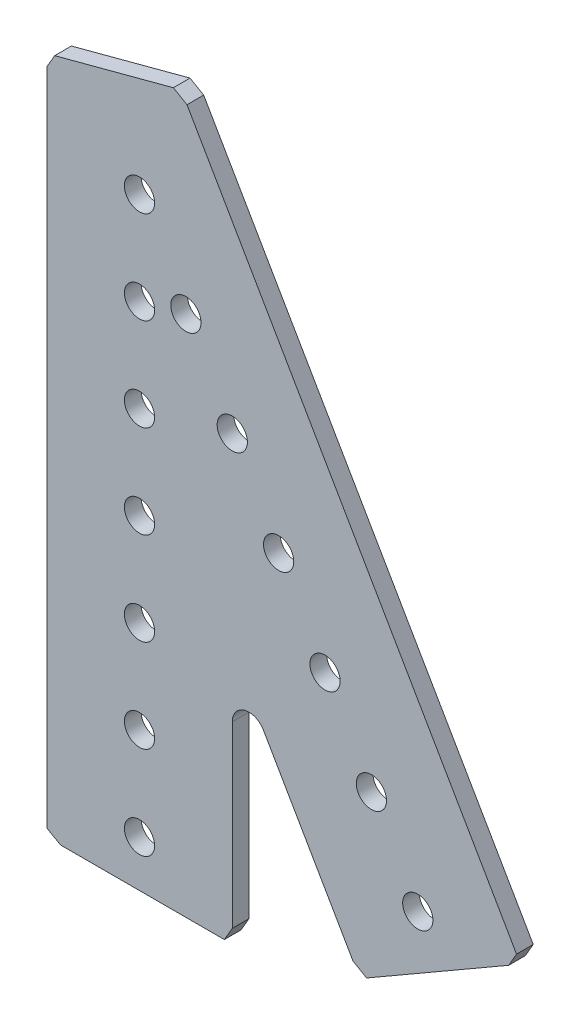
ISO-10303-21;
HEADER;
FILE_DESCRIPTION(('STEP AP214'),'2;1');
FILE_NAME('part.step','',(''),(''),'','','');
FILE_SCHEMA(('AUTOMOTIVE_DESIGN { 1 0 10303 214 1 1 1 1 }'));
ENDSEC;
DATA;
#1=APPLICATION_CONTEXT('core data for automotive mechanical design processes');
#2=APPLICATION_PROTOCOL_DEFINITION('international standard','automotive_design',2000,#1);
#3=PRODUCT_CONTEXT('',#1,'mechanical');
#4=PRODUCT('Part','Part','',(#3));
#5=PRODUCT_RELATED_PRODUCT_CATEGORY('part','',(#4));
#6=PRODUCT_DEFINITION_FORMATION('','',#4);
#7=PRODUCT_DEFINITION_CONTEXT('part definition',#1,'design');
#8=PRODUCT_DEFINITION('design','',#6,#7);
#9=PRODUCT_DEFINITION_SHAPE('','',#8);
#10=(LENGTH_UNIT() NAMED_UNIT(*) SI_UNIT(.MILLI.,.METRE.));
#11=(NAMED_UNIT(*) PLANE_ANGLE_UNIT() SI_UNIT($,.RADIAN.));
#12=(NAMED_UNIT(*) SI_UNIT($,.STERADIAN.) SOLID_ANGLE_UNIT());
#13=UNCERTAINTY_MEASURE_WITH_UNIT(LENGTH_MEASURE(1.E-05),#10,'distance_accuracy_value','');
#14=(GEOMETRIC_REPRESENTATION_CONTEXT(3) GLOBAL_UNCERTAINTY_ASSIGNED_CONTEXT((#13)) GLOBAL_UNIT_ASSIGNED_CONTEXT((#10,
#11,#12)) REPRESENTATION_CONTEXT('',''));
#15=CARTESIAN_POINT('',(0.,0.,0.));
#16=DIRECTION('',(0.,0.,1.));
#17=DIRECTION('',(1.,0.,0.));
#18=AXIS2_PLACEMENT_3D('',#15,#16,#17);
#19=CARTESIAN_POINT('',(31.098420175516,-77.3658481835008,2.286));
#20=DIRECTION('',(-0.501574169410907,-0.865114647072721,0.));
#21=DIRECTION('',(0.865114647072721,-0.501574169410907,0.));
#22=AXIS2_PLACEMENT_3D('',#19,#20,#21);
#23=PLANE('',#22);
#24=DIRECTION('',(-0.865114647072721,0.501574169410907,0.));
#25=VECTOR('',#24,1.);
#26=CARTESIAN_POINT('',(31.098420175516,-77.3658481835008,0.));
#27=LINE('',#26,#25);
#28=CARTESIAN_POINT('',(31.098420175516,-77.3658481835008,0.));
#29=VERTEX_POINT('',#28);
#30=CARTESIAN_POINT('',(29.230637652486,-76.2829495517427,0.));
#31=VERTEX_POINT('',#30);
#32=EDGE_CURVE('E166',#29,#31,#27,.T.);
#33=ORIENTED_EDGE('',*,*,#32,.F.);
#34=DIRECTION('',(0.,0.,-1.));
#35=VECTOR('',#34,1.);
#36=CARTESIAN_POINT('',(31.098420175516,-77.3658481835008,2.286));
#37=LINE('',#36,#35);
#38=CARTESIAN_POINT('',(31.098420175516,-77.3658481835008,2.286));
#39=VERTEX_POINT('',#38);
#40=EDGE_CURVE('E11',#39,#29,#37,.T.);
#41=ORIENTED_EDGE('',*,*,#40,.F.);
#42=DIRECTION('',(-0.865114647072721,0.501574169410907,0.));
#43=VECTOR('',#42,1.);
#44=CARTESIAN_POINT('',(31.098420175516,-77.3658481835008,2.286));
#45=LINE('',#44,#43);
#46=CARTESIAN_POINT('',(29.230637652486,-76.2829495517427,2.286));
#47=VERTEX_POINT('',#46);
#48=EDGE_CURVE('E205',#39,#47,#45,.T.);
#49=ORIENTED_EDGE('',*,*,#48,.T.);
#50=DIRECTION('',(0.,0.,-1.));
#51=VECTOR('',#50,1.);
#52=CARTESIAN_POINT('',(29.230637652486,-76.2829495517427,2.286));
#53=LINE('',#52,#51);
#54=EDGE_CURVE('E36',#47,#31,#53,.T.);
#55=ORIENTED_EDGE('',*,*,#54,.T.);
#56=EDGE_LOOP('',(#33,#41,#49,#55));
#57=FACE_BOUND('',#56,.T.);
#58=ADVANCED_FACE('F33',(#57),#23,.T.);
#59=CARTESIAN_POINT('',(50.5425898711182,-66.1397515755763,2.286));
#60=DIRECTION('',(0.499999999999995,-0.866025403784442,0.));
#61=DIRECTION('',(0.866025403784442,0.499999999999995,0.));
#62=AXIS2_PLACEMENT_3D('',#59,#60,#61);
#63=PLANE('',#62);
#64=DIRECTION('',(-0.866025403784442,-0.499999999999995,0.));
#65=VECTOR('',#64,1.);
#66=CARTESIAN_POINT('',(50.5425898711182,-66.1397515755763,0.));
#67=LINE('',#66,#65);
#68=CARTESIAN_POINT('',(50.5425898711182,-66.1397515755763,0.));
#69=VERTEX_POINT('',#68);
#70=EDGE_CURVE('E203',#69,#29,#67,.T.);
#71=ORIENTED_EDGE('',*,*,#70,.F.);
#72=DIRECTION('',(0.,0.,-1.));
#73=VECTOR('',#72,1.);
#74=CARTESIAN_POINT('',(50.5425898711182,-66.1397515755763,2.286));
#75=LINE('',#74,#73);
#76=CARTESIAN_POINT('',(50.5425898711182,-66.1397515755763,2.286));
#77=VERTEX_POINT('',#76);
#78=EDGE_CURVE('E42',#77,#69,#75,.T.);
#79=ORIENTED_EDGE('',*,*,#78,.F.);
#80=DIRECTION('',(-0.866025403784442,-0.499999999999995,0.));
#81=VECTOR('',#80,1.);
#82=CARTESIAN_POINT('',(50.5425898711182,-66.1397515755763,2.286));
#83=LINE('',#82,#81);
#84=EDGE_CURVE('E156',#77,#39,#83,.T.);
#85=ORIENTED_EDGE('',*,*,#84,.T.);
#86=ORIENTED_EDGE('',*,*,#40,.T.);
#87=EDGE_LOOP('',(#71,#79,#85,#86));
#88=FACE_BOUND('',#87,.T.);
#89=ADVANCED_FACE('F229',(#88),#63,.T.);
#90=CARTESIAN_POINT('',(51.6254885028765,-64.2719690525461,2.286));
#91=DIRECTION('',(0.865114647072718,-0.501574169410912,0.));
#92=DIRECTION('',(0.501574169410913,0.865114647072718,0.));
#93=AXIS2_PLACEMENT_3D('',#90,#91,#92);
#94=PLANE('',#93);
#95=DIRECTION('',(-0.501574169410913,-0.865114647072718,0.));
#96=VECTOR('',#95,1.);
#97=CARTESIAN_POINT('',(51.6254885028765,-64.2719690525461,0.));
#98=LINE('',#97,#96);
#99=CARTESIAN_POINT('',(51.6254885028765,-64.2719690525461,0.));
#100=VERTEX_POINT('',#99);
#101=EDGE_CURVE('E143',#100,#69,#98,.T.);
#102=ORIENTED_EDGE('',*,*,#101,.F.);
#103=DIRECTION('',(0.,0.,-1.));
#104=VECTOR('',#103,1.);
#105=CARTESIAN_POINT('',(51.6254885028765,-64.2719690525461,2.286));
#106=LINE('',#105,#104);
#107=CARTESIAN_POINT('',(51.6254885028765,-64.2719690525461,2.286));
#108=VERTEX_POINT('',#107);
#109=EDGE_CURVE('E138',#108,#100,#106,.T.);
#110=ORIENTED_EDGE('',*,*,#109,.F.);
#111=DIRECTION('',(-0.501574169410913,-0.865114647072718,0.));
#112=VECTOR('',#111,1.);
#113=CARTESIAN_POINT('',(51.6254885028765,-64.2719690525461,2.286));
#114=LINE('',#113,#112);
#115=EDGE_CURVE('E141',#108,#77,#114,.T.);
#116=ORIENTED_EDGE('',*,*,#115,.T.);
#117=ORIENTED_EDGE('',*,*,#78,.T.);
#118=EDGE_LOOP('',(#102,#110,#116,#117));
#119=FACE_BOUND('',#118,.T.);
#120=ADVANCED_FACE('F140',(#119),#94,.T.);
#121=CARTESIAN_POINT('',(6.50045885004739,13.8868749992073,2.286));
#122=DIRECTION('',(0.866025403784442,0.499999999999994,0.));
#123=DIRECTION('',(-0.499999999999995,0.866025403784442,0.));
#124=AXIS2_PLACEMENT_3D('',#121,#122,#123);
#125=PLANE('',#124);
#126=DIRECTION('',(0.499999999999994,-0.866025403784442,0.));
#127=VECTOR('',#126,1.);
#128=CARTESIAN_POINT('',(6.50045885004739,13.8868749992073,0.));
#129=LINE('',#128,#127);
#130=CARTESIAN_POINT('',(6.50045885004739,13.8868749992073,0.));
#131=VERTEX_POINT('',#130);
#132=EDGE_CURVE('E200',#131,#100,#129,.T.);
#133=ORIENTED_EDGE('',*,*,#132,.F.);
#134=DIRECTION('',(0.,0.,-1.));
#135=VECTOR('',#134,1.);
#136=CARTESIAN_POINT('',(6.50045885004739,13.8868749992073,2.286));
#137=LINE('',#136,#135);
#138=CARTESIAN_POINT('',(6.50045885004739,13.8868749992073,2.286));
#139=VERTEX_POINT('',#138);
#140=EDGE_CURVE('E148',#139,#131,#137,.T.);
#141=ORIENTED_EDGE('',*,*,#140,.F.);
#142=DIRECTION('',(0.499999999999994,-0.866025403784442,0.));
#143=VECTOR('',#142,1.);
#144=CARTESIAN_POINT('',(6.50045885004739,13.8868749992073,2.286));
#145=LINE('',#144,#143);
#146=EDGE_CURVE('E154',#139,#108,#145,.T.);
#147=ORIENTED_EDGE('',*,*,#146,.T.);
#148=ORIENTED_EDGE('',*,*,#109,.T.);
#149=EDGE_LOOP('',(#133,#141,#147,#148));
#150=FACE_BOUND('',#149,.T.);
#151=ADVANCED_FACE('F158',(#150),#125,.T.);
#152=CARTESIAN_POINT('',(4.63267632701638,14.969773630966,2.286));
#153=DIRECTION('',(0.501574169410913,0.865114647072718,0.));
#154=DIRECTION('',(-0.865114647072718,0.501574169410913,0.));
#155=AXIS2_PLACEMENT_3D('',#152,#153,#154);
#156=PLANE('',#155);
#157=DIRECTION('',(0.865114647072718,-0.501574169410913,0.));
#158=VECTOR('',#157,1.);
#159=CARTESIAN_POINT('',(4.63267632701638,14.969773630966,0.));
#160=LINE('',#159,#158);
#161=CARTESIAN_POINT('',(4.63267632701638,14.969773630966,0.));
#162=VERTEX_POINT('',#161);
#163=EDGE_CURVE('E197',#162,#131,#160,.T.);
#164=ORIENTED_EDGE('',*,*,#163,.F.);
#165=DIRECTION('',(0.,0.,-1.));
#166=VECTOR('',#165,1.);
#167=CARTESIAN_POINT('',(4.63267632701638,14.969773630966,2.286));
#168=LINE('',#167,#166);
#169=CARTESIAN_POINT('',(4.63267632701638,14.969773630966,2.286));
#170=VERTEX_POINT('',#169);
#171=EDGE_CURVE('E209',#170,#162,#168,.T.);
#172=ORIENTED_EDGE('',*,*,#171,.F.);
#173=DIRECTION('',(0.865114647072718,-0.501574169410913,0.));
#174=VECTOR('',#173,1.);
#175=CARTESIAN_POINT('',(4.63267632701638,14.969773630966,2.286));
#176=LINE('',#175,#174);
#177=EDGE_CURVE('E159',#170,#139,#176,.T.);
#178=ORIENTED_EDGE('',*,*,#177,.T.);
#179=ORIENTED_EDGE('',*,*,#140,.T.);
#180=EDGE_LOOP('',(#164,#172,#178,#179));
#181=FACE_BOUND('',#180,.T.);
#182=ADVANCED_FACE('F242',(#181),#156,.T.);
#183=CARTESIAN_POINT('',(-11.6171013682418,10.6473178722135,2.286));
#184=DIRECTION('',(-0.257061936990462,0.966394929907392,0.));
#185=DIRECTION('',(-0.966394929907391,-0.257061936990462,0.));
#186=AXIS2_PLACEMENT_3D('',#183,#184,#185);
#187=PLANE('',#186);
#188=DIRECTION('',(0.966394929907391,0.257061936990462,0.));
#189=VECTOR('',#188,1.);
#190=CARTESIAN_POINT('',(-11.6171013682418,10.6473178722135,0.));
#191=LINE('',#190,#189);
#192=CARTESIAN_POINT('',(-11.6171013682418,10.6473178722135,0.));
#193=VERTEX_POINT('',#192);
#194=EDGE_CURVE('E194',#193,#162,#191,.T.);
#195=ORIENTED_EDGE('',*,*,#194,.F.);
#196=DIRECTION('',(0.,0.,-1.));
#197=VECTOR('',#196,1.);
#198=CARTESIAN_POINT('',(-11.6171013682418,10.6473178722135,2.286));
#199=LINE('',#198,#197);
#200=CARTESIAN_POINT('',(-11.6171013682418,10.6473178722135,2.286));
#201=VERTEX_POINT('',#200);
#202=EDGE_CURVE('E211',#201,#193,#199,.T.);
#203=ORIENTED_EDGE('',*,*,#202,.F.);
#204=DIRECTION('',(0.966394929907391,0.257061936990462,0.));
#205=VECTOR('',#204,1.);
#206=CARTESIAN_POINT('',(-11.6171013682418,10.6473178722135,2.286));
#207=LINE('',#206,#205);
#208=EDGE_CURVE('E161',#201,#170,#207,.T.);
#209=ORIENTED_EDGE('',*,*,#208,.T.);
#210=ORIENTED_EDGE('',*,*,#171,.T.);
#211=EDGE_LOOP('',(#195,#203,#209,#210));
#212=FACE_BOUND('',#211,.T.);
#213=ADVANCED_FACE('F245',(#212),#187,.T.);
#214=CARTESIAN_POINT('',(-12.7,8.77953534918344,2.286));
#215=DIRECTION('',(-0.865114647072722,0.501574169410905,0.));
#216=DIRECTION('',(-0.501574169410906,-0.865114647072722,0.));
#217=AXIS2_PLACEMENT_3D('',#214,#215,#216);
#218=PLANE('',#217);
#219=DIRECTION('',(0.501574169410905,0.865114647072722,0.));
#220=VECTOR('',#219,1.);
#221=CARTESIAN_POINT('',(-12.7,8.77953534918344,0.));
#222=LINE('',#221,#220);
#223=CARTESIAN_POINT('',(-12.7,8.77953534918344,0.));
#224=VERTEX_POINT('',#223);
#225=EDGE_CURVE('E191',#224,#193,#222,.T.);
#226=ORIENTED_EDGE('',*,*,#225,.F.);
#227=DIRECTION('',(0.,0.,-1.));
#228=VECTOR('',#227,1.);
#229=CARTESIAN_POINT('',(-12.7,8.77953534918344,2.286));
#230=LINE('',#229,#228);
#231=CARTESIAN_POINT('',(-12.7,8.77953534918344,2.286));
#232=VERTEX_POINT('',#231);
#233=EDGE_CURVE('E213',#232,#224,#230,.T.);
#234=ORIENTED_EDGE('',*,*,#233,.F.);
#235=DIRECTION('',(0.501574169410905,0.865114647072722,0.));
#236=VECTOR('',#235,1.);
#237=CARTESIAN_POINT('',(-12.7,8.77953534918344,2.286));
#238=LINE('',#237,#236);
#239=EDGE_CURVE('E443',#232,#201,#238,.T.);
#240=ORIENTED_EDGE('',*,*,#239,.T.);
#241=ORIENTED_EDGE('',*,*,#202,.T.);
#242=EDGE_LOOP('',(#226,#234,#240,#241));
#243=FACE_BOUND('',#242,.T.);
#244=ADVANCED_FACE('F249',(#243),#218,.T.);
#245=CARTESIAN_POINT('',(-12.7,-81.4671013682419,2.286));
#246=DIRECTION('',(-1.,0.,0.));
#247=DIRECTION('',(0.,-1.,0.));
#248=AXIS2_PLACEMENT_3D('',#245,#246,#247);
#249=PLANE('',#248);
#250=DIRECTION('',(0.,1.,0.));
#251=VECTOR('',#250,1.);
#252=CARTESIAN_POINT('',(-12.7,-81.4671013682419,0.));
#253=LINE('',#252,#251);
#254=CARTESIAN_POINT('',(-12.7,-81.4671013682419,0.));
#255=VERTEX_POINT('',#254);
#256=EDGE_CURVE('E188',#255,#224,#253,.T.);
#257=ORIENTED_EDGE('',*,*,#256,.F.);
#258=DIRECTION('',(0.,0.,-1.));
#259=VECTOR('',#258,1.);
#260=CARTESIAN_POINT('',(-12.7,-81.4671013682419,2.286));
#261=LINE('',#260,#259);
#262=CARTESIAN_POINT('',(-12.7,-81.4671013682419,2.286));
#263=VERTEX_POINT('',#262);
#264=EDGE_CURVE('E215',#263,#255,#261,.T.);
#265=ORIENTED_EDGE('',*,*,#264,.F.);
#266=DIRECTION('',(0.,1.,0.));
#267=VECTOR('',#266,1.);
#268=CARTESIAN_POINT('',(-12.7,-81.4671013682419,2.286));
#269=LINE('',#268,#267);
#270=EDGE_CURVE('E440',#263,#232,#269,.T.);
#271=ORIENTED_EDGE('',*,*,#270,.T.);
#272=ORIENTED_EDGE('',*,*,#233,.T.);
#273=EDGE_LOOP('',(#257,#265,#271,#272));
#274=FACE_BOUND('',#273,.T.);
#275=ADVANCED_FACE('F253',(#274),#249,.T.);
#276=CARTESIAN_POINT('',(-10.83221747697,-82.55,2.286));
#277=DIRECTION('',(-0.501574169410903,-0.865114647072723,0.));
#278=DIRECTION('',(0.865114647072723,-0.501574169410903,0.));
#279=AXIS2_PLACEMENT_3D('',#276,#277,#278);
#280=PLANE('',#279);
#281=DIRECTION('',(-0.865114647072723,0.501574169410903,0.));
#282=VECTOR('',#281,1.);
#283=CARTESIAN_POINT('',(-10.83221747697,-82.55,0.));
#284=LINE('',#283,#282);
#285=CARTESIAN_POINT('',(-10.83221747697,-82.55,0.));
#286=VERTEX_POINT('',#285);
#287=EDGE_CURVE('E185',#286,#255,#284,.T.);
#288=ORIENTED_EDGE('',*,*,#287,.F.);
#289=DIRECTION('',(0.,0.,-1.));
#290=VECTOR('',#289,1.);
#291=CARTESIAN_POINT('',(-10.83221747697,-82.55,2.286));
#292=LINE('',#291,#290);
#293=CARTESIAN_POINT('',(-10.83221747697,-82.55,2.286));
#294=VERTEX_POINT('',#293);
#295=EDGE_CURVE('E217',#294,#286,#292,.T.);
#296=ORIENTED_EDGE('',*,*,#295,.F.);
#297=DIRECTION('',(-0.865114647072723,0.501574169410903,0.));
#298=VECTOR('',#297,1.);
#299=CARTESIAN_POINT('',(-10.83221747697,-82.55,2.286));
#300=LINE('',#299,#298);
#301=EDGE_CURVE('E437',#294,#263,#300,.T.);
#302=ORIENTED_EDGE('',*,*,#301,.T.);
#303=ORIENTED_EDGE('',*,*,#264,.T.);
#304=EDGE_LOOP('',(#288,#296,#302,#303));
#305=FACE_BOUND('',#304,.T.);
#306=ADVANCED_FACE('F257',(#305),#280,.T.);
#307=CARTESIAN_POINT('',(11.6171013682419,-82.55,2.286));
#308=DIRECTION('',(0.,-1.,0.));
#309=DIRECTION('',(0.,0.,-1.));
#310=AXIS2_PLACEMENT_3D('',#307,#308,#309);
#311=PLANE('',#310);
#312=DIRECTION('',(-1.,0.,0.));
#313=VECTOR('',#312,1.);
#314=CARTESIAN_POINT('',(11.6171013682419,-82.55,0.));
#315=LINE('',#314,#313);
#316=CARTESIAN_POINT('',(11.6171013682419,-82.55,0.));
#317=VERTEX_POINT('',#316);
#318=EDGE_CURVE('E182',#317,#286,#315,.T.);
#319=ORIENTED_EDGE('',*,*,#318,.F.);
#320=DIRECTION('',(0.,0.,-1.));
#321=VECTOR('',#320,1.);
#322=CARTESIAN_POINT('',(11.6171013682419,-82.55,2.286));
#323=LINE('',#322,#321);
#324=CARTESIAN_POINT('',(11.6171013682419,-82.55,2.286));
#325=VERTEX_POINT('',#324);
#326=EDGE_CURVE('E219',#325,#317,#323,.T.);
#327=ORIENTED_EDGE('',*,*,#326,.F.);
#328=DIRECTION('',(-1.,0.,0.));
#329=VECTOR('',#328,1.);
#330=CARTESIAN_POINT('',(11.6171013682419,-82.55,2.286));
#331=LINE('',#330,#329);
#332=EDGE_CURVE('E434',#325,#294,#331,.T.);
#333=ORIENTED_EDGE('',*,*,#332,.T.);
#334=ORIENTED_EDGE('',*,*,#295,.T.);
#335=EDGE_LOOP('',(#319,#327,#333,#334));
#336=FACE_BOUND('',#335,.T.);
#337=ADVANCED_FACE('F261',(#336),#311,.T.);
#338=CARTESIAN_POINT('',(12.7,-80.68221747697,2.286));
#339=DIRECTION('',(0.865114647072722,-0.501574169410906,0.));
#340=DIRECTION('',(0.501574169410906,0.865114647072722,0.));
#341=AXIS2_PLACEMENT_3D('',#338,#339,#340);
#342=PLANE('',#341);
#343=DIRECTION('',(-0.501574169410906,-0.865114647072722,0.));
#344=VECTOR('',#343,1.);
#345=CARTESIAN_POINT('',(12.7,-80.68221747697,0.));
#346=LINE('',#345,#344);
#347=CARTESIAN_POINT('',(12.7,-80.68221747697,0.));
#348=VERTEX_POINT('',#347);
#349=EDGE_CURVE('E179',#348,#317,#346,.T.);
#350=ORIENTED_EDGE('',*,*,#349,.F.);
#351=DIRECTION('',(0.,0.,-1.));
#352=VECTOR('',#351,1.);
#353=CARTESIAN_POINT('',(12.7,-80.68221747697,2.286));
#354=LINE('',#353,#352);
#355=CARTESIAN_POINT('',(12.7,-80.68221747697,2.286));
#356=VERTEX_POINT('',#355);
#357=EDGE_CURVE('E221',#356,#348,#354,.T.);
#358=ORIENTED_EDGE('',*,*,#357,.F.);
#359=DIRECTION('',(-0.501574169410906,-0.865114647072722,0.));
#360=VECTOR('',#359,1.);
#361=CARTESIAN_POINT('',(12.7,-80.68221747697,2.286));
#362=LINE('',#361,#360);
#363=EDGE_CURVE('E431',#356,#325,#362,.T.);
#364=ORIENTED_EDGE('',*,*,#363,.T.);
#365=ORIENTED_EDGE('',*,*,#326,.T.);
#366=EDGE_LOOP('',(#350,#358,#364,#365));
#367=FACE_BOUND('',#366,.T.);
#368=ADVANCED_FACE('F265',(#367),#342,.T.);
#369=CARTESIAN_POINT('',(12.7,-56.1825134022283,2.286));
#370=DIRECTION('',(1.,0.,0.));
#371=DIRECTION('',(0.,0.,-1.));
#372=AXIS2_PLACEMENT_3D('',#369,#370,#371);
#373=PLANE('',#372);
#374=DIRECTION('',(0.,-1.,0.));
#375=VECTOR('',#374,1.);
#376=CARTESIAN_POINT('',(12.7,-56.1825134022283,0.));
#377=LINE('',#376,#375);
#378=CARTESIAN_POINT('',(12.7,-56.1825134022283,0.));
#379=VERTEX_POINT('',#378);
#380=EDGE_CURVE('E176',#379,#348,#377,.T.);
#381=ORIENTED_EDGE('',*,*,#380,.F.);
#382=DIRECTION('',(0.,0.,-1.));
#383=VECTOR('',#382,1.);
#384=CARTESIAN_POINT('',(12.7,-56.1825134022283,2.286));
#385=LINE('',#384,#383);
#386=CARTESIAN_POINT('',(12.7,-56.1825134022283,2.286));
#387=VERTEX_POINT('',#386);
#388=EDGE_CURVE('E223',#387,#379,#385,.T.);
#389=ORIENTED_EDGE('',*,*,#388,.F.);
#390=DIRECTION('',(0.,-1.,0.));
#391=VECTOR('',#390,1.);
#392=CARTESIAN_POINT('',(12.7,-56.1825134022283,2.286));
#393=LINE('',#392,#391);
#394=EDGE_CURVE('E428',#387,#356,#393,.T.);
#395=ORIENTED_EDGE('',*,*,#394,.T.);
#396=ORIENTED_EDGE('',*,*,#357,.T.);
#397=EDGE_LOOP('',(#381,#389,#395,#396));
#398=FACE_BOUND('',#397,.T.);
#399=ADVANCED_FACE('F269',(#398),#373,.T.);
#400=CARTESIAN_POINT('',(14.986,-56.1825134022283,2.286));
#401=DIRECTION('',(0.,0.,-1.));
#402=DIRECTION('',(-1.,0.,0.));
#403=AXIS2_PLACEMENT_3D('',#400,#401,#402);
#404=CYLINDRICAL_SURFACE('',#403,2.28600000000001);
#405=CARTESIAN_POINT('',(14.986,-56.1825134022283,0.));
#406=DIRECTION('',(0.,0.,1.));
#407=DIRECTION('',(1.,0.,0.));
#408=AXIS2_PLACEMENT_3D('',#405,#406,#407);
#409=CIRCLE('',#408,2.28600000000001);
#410=CARTESIAN_POINT('',(16.9657340730513,-55.0395134022283,0.));
#411=VERTEX_POINT('',#410);
#412=EDGE_CURVE('E173',#411,#379,#409,.T.);
#413=ORIENTED_EDGE('',*,*,#412,.F.);
#414=DIRECTION('',(0.,0.,-1.));
#415=VECTOR('',#414,1.);
#416=CARTESIAN_POINT('',(16.9657340730513,-55.0395134022283,2.286));
#417=LINE('',#416,#415);
#418=CARTESIAN_POINT('',(16.9657340730513,-55.0395134022283,2.286));
#419=VERTEX_POINT('',#418);
#420=EDGE_CURVE('E224',#419,#411,#417,.T.);
#421=ORIENTED_EDGE('',*,*,#420,.F.);
#422=CARTESIAN_POINT('',(14.986,-56.1825134022283,2.286));
#423=DIRECTION('',(0.,0.,1.));
#424=DIRECTION('',(1.,0.,0.));
#425=AXIS2_PLACEMENT_3D('',#422,#423,#424);
#426=CIRCLE('',#425,2.28600000000001);
#427=EDGE_CURVE('E425',#419,#387,#426,.T.);
#428=ORIENTED_EDGE('',*,*,#427,.T.);
#429=ORIENTED_EDGE('',*,*,#388,.T.);
#430=EDGE_LOOP('',(#413,#421,#428,#429));
#431=FACE_BOUND('',#430,.T.);
#432=ADVANCED_FACE('F273',(#431),#404,.F.);
#433=CARTESIAN_POINT('',(29.230637652486,-76.2829495517427,2.286));
#434=DIRECTION('',(-0.866025403784438,-0.5,0.));
#435=DIRECTION('',(0.5,-0.866025403784438,0.));
#436=AXIS2_PLACEMENT_3D('',#433,#434,#435);
#437=PLANE('',#436);
#438=DIRECTION('',(-0.5,0.866025403784438,0.));
#439=VECTOR('',#438,1.);
#440=CARTESIAN_POINT('',(29.230637652486,-76.2829495517427,0.));
#441=LINE('',#440,#439);
#442=EDGE_CURVE('E169',#31,#411,#441,.T.);
#443=ORIENTED_EDGE('',*,*,#442,.F.);
#444=ORIENTED_EDGE('',*,*,#54,.F.);
#445=DIRECTION('',(-0.5,0.866025403784438,0.));
#446=VECTOR('',#445,1.);
#447=CARTESIAN_POINT('',(29.230637652486,-76.2829495517427,2.286));
#448=LINE('',#447,#446);
#449=EDGE_CURVE('E423',#47,#419,#448,.T.);
#450=ORIENTED_EDGE('',*,*,#449,.T.);
#451=ORIENTED_EDGE('',*,*,#420,.T.);
#452=EDGE_LOOP('',(#443,#444,#450,#451));
#453=FACE_BOUND('',#452,.T.);
#454=ADVANCED_FACE('F226',(#453),#437,.T.);
#455=CARTESIAN_POINT('',(14.986,-56.1825134022283,2.286));
#456=DIRECTION('',(0.,0.,1.));
#457=DIRECTION('',(1.,0.,0.));
#458=AXIS2_PLACEMENT_3D('',#455,#456,#457);
#459=PLANE('',#458);
#460=CARTESIAN_POINT('',(0.,-76.2,2.286));
#461=DIRECTION('',(0.,0.,-1.));
#462=DIRECTION('',(1.,0.,0.));
#463=AXIS2_PLACEMENT_3D('',#460,#461,#462);
#464=CIRCLE('',#463,2.0701);
#465=CARTESIAN_POINT('',(2.07010000000001,-76.2,2.286));
#466=VERTEX_POINT('',#465);
#467=EDGE_CURVE('E344',#466,#466,#464,.T.);
#468=ORIENTED_EDGE('',*,*,#467,.T.);
#469=EDGE_LOOP('',(#468));
#470=FACE_BOUND('',#469,.T.);
#471=CARTESIAN_POINT('',(31.7499999999996,-54.992613140312,2.286));
#472=DIRECTION('',(0.,0.,-1.));
#473=DIRECTION('',(1.,0.,0.));
#474=AXIS2_PLACEMENT_3D('',#471,#472,#473);
#475=CIRCLE('',#474,2.0701);
#476=CARTESIAN_POINT('',(33.8200999999996,-54.992613140312,2.286));
#477=VERTEX_POINT('',#476);
#478=EDGE_CURVE('E352',#477,#477,#475,.T.);
#479=ORIENTED_EDGE('',*,*,#478,.T.);
#480=EDGE_LOOP('',(#479));
#481=FACE_BOUND('',#480,.T.);
#482=CARTESIAN_POINT('',(19.0499999999998,-32.9955678841872,2.286));
#483=DIRECTION('',(0.,0.,-1.));
#484=DIRECTION('',(1.,0.,0.));
#485=AXIS2_PLACEMENT_3D('',#482,#483,#484);
#486=CIRCLE('',#485,2.0701);
#487=CARTESIAN_POINT('',(21.1200999999998,-32.9955678841872,2.286));
#488=VERTEX_POINT('',#487);
#489=EDGE_CURVE('E358',#488,#488,#486,.T.);
#490=ORIENTED_EDGE('',*,*,#489,.T.);
#491=EDGE_LOOP('',(#490));
#492=FACE_BOUND('',#491,.T.);
#493=CARTESIAN_POINT('',(0.,-50.8,2.286));
#494=DIRECTION('',(0.,0.,-1.));
#495=DIRECTION('',(1.,0.,0.));
#496=AXIS2_PLACEMENT_3D('',#493,#494,#495);
#497=CIRCLE('',#496,2.0701);
#498=CARTESIAN_POINT('',(2.07010000000001,-50.8,2.286));
#499=VERTEX_POINT('',#498);
#500=EDGE_CURVE('E364',#499,#499,#497,.T.);
#501=ORIENTED_EDGE('',*,*,#500,.T.);
#502=EDGE_LOOP('',(#501));
#503=FACE_BOUND('',#502,.T.);
#504=CARTESIAN_POINT('',(2.66050878019847E-13,-25.4,2.286));
#505=DIRECTION('',(0.,0.,-1.));
#506=DIRECTION('',(1.,0.,0.));
#507=AXIS2_PLACEMENT_3D('',#504,#505,#506);
#508=CIRCLE('',#507,2.0701);
#509=CARTESIAN_POINT('',(2.07010000000027,-25.4,2.286));
#510=VERTEX_POINT('',#509);
#511=EDGE_CURVE('E370',#510,#510,#508,.T.);
#512=ORIENTED_EDGE('',*,*,#511,.T.);
#513=EDGE_LOOP('',(#512));
#514=FACE_BOUND('',#513,.T.);
#515=CARTESIAN_POINT('',(6.34999999999993,-10.9985226280624,2.286));
#516=DIRECTION('',(0.,0.,-1.));
#517=DIRECTION('',(1.,0.,0.));
#518=AXIS2_PLACEMENT_3D('',#515,#516,#517);
#519=CIRCLE('',#518,2.0701);
#520=CARTESIAN_POINT('',(8.42009999999993,-10.9985226280624,2.286));
#521=VERTEX_POINT('',#520);
#522=EDGE_CURVE('E376',#521,#521,#519,.T.);
#523=ORIENTED_EDGE('',*,*,#522,.T.);
#524=EDGE_LOOP('',(#523));
#525=FACE_BOUND('',#524,.T.);
#526=CARTESIAN_POINT('',(0.,0.,2.286));
#527=DIRECTION('',(0.,0.,-1.));
#528=DIRECTION('',(1.,0.,0.));
#529=AXIS2_PLACEMENT_3D('',#526,#527,#528);
#530=CIRCLE('',#529,2.0701);
#531=CARTESIAN_POINT('',(2.0701,0.,2.286));
#532=VERTEX_POINT('',#531);
#533=EDGE_CURVE('E382',#532,#532,#530,.T.);
#534=ORIENTED_EDGE('',*,*,#533,.T.);
#535=EDGE_LOOP('',(#534));
#536=FACE_BOUND('',#535,.T.);
#537=CARTESIAN_POINT('',(1.33025439009923E-13,-12.7,2.286));
#538=DIRECTION('',(0.,0.,-1.));
#539=DIRECTION('',(1.,0.,0.));
#540=AXIS2_PLACEMENT_3D('',#537,#538,#539);
#541=CIRCLE('',#540,2.0701);
#542=CARTESIAN_POINT('',(2.07010000000013,-12.7,2.286));
#543=VERTEX_POINT('',#542);
#544=EDGE_CURVE('E388',#543,#543,#541,.T.);
#545=ORIENTED_EDGE('',*,*,#544,.T.);
#546=EDGE_LOOP('',(#545));
#547=FACE_BOUND('',#546,.T.);
#548=CARTESIAN_POINT('',(3.9907631702977E-13,-38.1,2.286));
#549=DIRECTION('',(0.,0.,-1.));
#550=DIRECTION('',(1.,0.,0.));
#551=AXIS2_PLACEMENT_3D('',#548,#549,#550);
#552=CIRCLE('',#551,2.0701);
#553=CARTESIAN_POINT('',(2.0701000000004,-38.1,2.286));
#554=VERTEX_POINT('',#553);
#555=EDGE_CURVE('E394',#554,#554,#552,.T.);
#556=ORIENTED_EDGE('',*,*,#555,.T.);
#557=EDGE_LOOP('',(#556));
#558=FACE_BOUND('',#557,.T.);
#559=CARTESIAN_POINT('',(12.6999999999999,-21.9970452561248,2.286));
#560=DIRECTION('',(0.,0.,-1.));
#561=DIRECTION('',(1.,0.,0.));
#562=AXIS2_PLACEMENT_3D('',#559,#560,#561);
#563=CIRCLE('',#562,2.0701);
#564=CARTESIAN_POINT('',(14.7700999999999,-21.9970452561248,2.286));
#565=VERTEX_POINT('',#564);
#566=EDGE_CURVE('E400',#565,#565,#563,.T.);
#567=ORIENTED_EDGE('',*,*,#566,.T.);
#568=EDGE_LOOP('',(#567));
#569=FACE_BOUND('',#568,.T.);
#570=CARTESIAN_POINT('',(25.3999999999997,-43.9940905122496,2.286));
#571=DIRECTION('',(0.,0.,-1.));
#572=DIRECTION('',(1.,0.,0.));
#573=AXIS2_PLACEMENT_3D('',#570,#571,#572);
#574=CIRCLE('',#573,2.0701);
#575=CARTESIAN_POINT('',(27.4700999999997,-43.9940905122496,2.286));
#576=VERTEX_POINT('',#575);
#577=EDGE_CURVE('E406',#576,#576,#574,.T.);
#578=ORIENTED_EDGE('',*,*,#577,.T.);
#579=EDGE_LOOP('',(#578));
#580=FACE_BOUND('',#579,.T.);
#581=CARTESIAN_POINT('',(0.,-63.5,2.286));
#582=DIRECTION('',(0.,0.,-1.));
#583=DIRECTION('',(1.,0.,0.));
#584=AXIS2_PLACEMENT_3D('',#581,#582,#583);
#585=CIRCLE('',#584,2.0701);
#586=CARTESIAN_POINT('',(2.07010000000001,-63.5,2.286));
#587=VERTEX_POINT('',#586);
#588=EDGE_CURVE('E412',#587,#587,#585,.T.);
#589=ORIENTED_EDGE('',*,*,#588,.T.);
#590=EDGE_LOOP('',(#589));
#591=FACE_BOUND('',#590,.T.);
#592=CARTESIAN_POINT('',(38.0999999999996,-65.9911357683745,2.286));
#593=DIRECTION('',(0.,0.,-1.));
#594=DIRECTION('',(1.,0.,0.));
#595=AXIS2_PLACEMENT_3D('',#592,#593,#594);
#596=CIRCLE('',#595,2.0701);
#597=CARTESIAN_POINT('',(40.1700999999996,-65.9911357683745,2.286));
#598=VERTEX_POINT('',#597);
#599=EDGE_CURVE('E170',#598,#598,#596,.T.);
#600=ORIENTED_EDGE('',*,*,#599,.T.);
#601=EDGE_LOOP('',(#600));
#602=FACE_BOUND('',#601,.T.);
#603=ORIENTED_EDGE('',*,*,#48,.F.);
#604=ORIENTED_EDGE('',*,*,#84,.F.);
#605=ORIENTED_EDGE('',*,*,#115,.F.);
#606=ORIENTED_EDGE('',*,*,#146,.F.);
#607=ORIENTED_EDGE('',*,*,#177,.F.);
#608=ORIENTED_EDGE('',*,*,#208,.F.);
#609=ORIENTED_EDGE('',*,*,#239,.F.);
#610=ORIENTED_EDGE('',*,*,#270,.F.);
#611=ORIENTED_EDGE('',*,*,#301,.F.);
#612=ORIENTED_EDGE('',*,*,#332,.F.);
#613=ORIENTED_EDGE('',*,*,#363,.F.);
#614=ORIENTED_EDGE('',*,*,#394,.F.);
#615=ORIENTED_EDGE('',*,*,#427,.F.);
#616=ORIENTED_EDGE('',*,*,#449,.F.);
#617=EDGE_LOOP('',(#603,#604,#605,#606,#607,#608,#609,#610,#611,#612,#613,#614,#615,#616));
#618=FACE_BOUND('',#617,.T.);
#619=ADVANCED_FACE('F152',(#470,#481,#492,#503,#514,#525,#536,#547,#558,#569,#580,#591,#602,
#618),#459,.T.);
#620=CARTESIAN_POINT('',(14.986,-56.1825134022283,0.));
#621=DIRECTION('',(0.,0.,1.));
#622=DIRECTION('',(1.,0.,0.));
#623=AXIS2_PLACEMENT_3D('',#620,#621,#622);
#624=PLANE('',#623);
#625=CARTESIAN_POINT('',(0.,-76.2,0.));
#626=DIRECTION('',(0.,0.,-1.));
#627=DIRECTION('',(1.,0.,0.));
#628=AXIS2_PLACEMENT_3D('',#625,#626,#627);
#629=CIRCLE('',#628,2.0701);
#630=CARTESIAN_POINT('',(2.07010000000001,-76.2,0.));
#631=VERTEX_POINT('',#630);
#632=EDGE_CURVE('E347',#631,#631,#629,.T.);
#633=ORIENTED_EDGE('',*,*,#632,.F.);
#634=EDGE_LOOP('',(#633));
#635=FACE_BOUND('',#634,.T.);
#636=CARTESIAN_POINT('',(31.7499999999996,-54.992613140312,0.));
#637=DIRECTION('',(0.,0.,-1.));
#638=DIRECTION('',(1.,0.,0.));
#639=AXIS2_PLACEMENT_3D('',#636,#637,#638);
#640=CIRCLE('',#639,2.0701);
#641=CARTESIAN_POINT('',(33.8200999999996,-54.992613140312,0.));
#642=VERTEX_POINT('',#641);
#643=EDGE_CURVE('E349',#642,#642,#640,.T.);
#644=ORIENTED_EDGE('',*,*,#643,.F.);
#645=EDGE_LOOP('',(#644));
#646=FACE_BOUND('',#645,.T.);
#647=CARTESIAN_POINT('',(19.0499999999998,-32.9955678841872,0.));
#648=DIRECTION('',(0.,0.,-1.));
#649=DIRECTION('',(1.,0.,0.));
#650=AXIS2_PLACEMENT_3D('',#647,#648,#649);
#651=CIRCLE('',#650,2.0701);
#652=CARTESIAN_POINT('',(21.1200999999998,-32.9955678841872,0.));
#653=VERTEX_POINT('',#652);
#654=EDGE_CURVE('E355',#653,#653,#651,.T.);
#655=ORIENTED_EDGE('',*,*,#654,.F.);
#656=EDGE_LOOP('',(#655));
#657=FACE_BOUND('',#656,.T.);
#658=CARTESIAN_POINT('',(0.,-50.8,0.));
#659=DIRECTION('',(0.,0.,-1.));
#660=DIRECTION('',(1.,0.,0.));
#661=AXIS2_PLACEMENT_3D('',#658,#659,#660);
#662=CIRCLE('',#661,2.0701);
#663=CARTESIAN_POINT('',(2.07010000000001,-50.8,0.));
#664=VERTEX_POINT('',#663);
#665=EDGE_CURVE('E361',#664,#664,#662,.T.);
#666=ORIENTED_EDGE('',*,*,#665,.F.);
#667=EDGE_LOOP('',(#666));
#668=FACE_BOUND('',#667,.T.);
#669=CARTESIAN_POINT('',(2.66050878019847E-13,-25.4,0.));
#670=DIRECTION('',(0.,0.,-1.));
#671=DIRECTION('',(1.,0.,0.));
#672=AXIS2_PLACEMENT_3D('',#669,#670,#671);
#673=CIRCLE('',#672,2.0701);
#674=CARTESIAN_POINT('',(2.07010000000027,-25.4,0.));
#675=VERTEX_POINT('',#674);
#676=EDGE_CURVE('E367',#675,#675,#673,.T.);
#677=ORIENTED_EDGE('',*,*,#676,.F.);
#678=EDGE_LOOP('',(#677));
#679=FACE_BOUND('',#678,.T.);
#680=CARTESIAN_POINT('',(6.34999999999993,-10.9985226280624,0.));
#681=DIRECTION('',(0.,0.,-1.));
#682=DIRECTION('',(1.,0.,0.));
#683=AXIS2_PLACEMENT_3D('',#680,#681,#682);
#684=CIRCLE('',#683,2.0701);
#685=CARTESIAN_POINT('',(8.42009999999993,-10.9985226280624,0.));
#686=VERTEX_POINT('',#685);
#687=EDGE_CURVE('E373',#686,#686,#684,.T.);
#688=ORIENTED_EDGE('',*,*,#687,.F.);
#689=EDGE_LOOP('',(#688));
#690=FACE_BOUND('',#689,.T.);
#691=CARTESIAN_POINT('',(0.,0.,0.));
#692=DIRECTION('',(0.,0.,-1.));
#693=DIRECTION('',(1.,0.,0.));
#694=AXIS2_PLACEMENT_3D('',#691,#692,#693);
#695=CIRCLE('',#694,2.0701);
#696=CARTESIAN_POINT('',(2.0701,0.,0.));
#697=VERTEX_POINT('',#696);
#698=EDGE_CURVE('E379',#697,#697,#695,.T.);
#699=ORIENTED_EDGE('',*,*,#698,.F.);
#700=EDGE_LOOP('',(#699));
#701=FACE_BOUND('',#700,.T.);
#702=CARTESIAN_POINT('',(1.33025439009923E-13,-12.7,0.));
#703=DIRECTION('',(0.,0.,-1.));
#704=DIRECTION('',(1.,0.,0.));
#705=AXIS2_PLACEMENT_3D('',#702,#703,#704);
#706=CIRCLE('',#705,2.0701);
#707=CARTESIAN_POINT('',(2.07010000000013,-12.7,0.));
#708=VERTEX_POINT('',#707);
#709=EDGE_CURVE('E385',#708,#708,#706,.T.);
#710=ORIENTED_EDGE('',*,*,#709,.F.);
#711=EDGE_LOOP('',(#710));
#712=FACE_BOUND('',#711,.T.);
#713=CARTESIAN_POINT('',(3.9907631702977E-13,-38.1,0.));
#714=DIRECTION('',(0.,0.,-1.));
#715=DIRECTION('',(1.,0.,0.));
#716=AXIS2_PLACEMENT_3D('',#713,#714,#715);
#717=CIRCLE('',#716,2.0701);
#718=CARTESIAN_POINT('',(2.0701000000004,-38.1,0.));
#719=VERTEX_POINT('',#718);
#720=EDGE_CURVE('E391',#719,#719,#717,.T.);
#721=ORIENTED_EDGE('',*,*,#720,.F.);
#722=EDGE_LOOP('',(#721));
#723=FACE_BOUND('',#722,.T.);
#724=CARTESIAN_POINT('',(12.6999999999999,-21.9970452561248,0.));
#725=DIRECTION('',(0.,0.,-1.));
#726=DIRECTION('',(1.,0.,0.));
#727=AXIS2_PLACEMENT_3D('',#724,#725,#726);
#728=CIRCLE('',#727,2.0701);
#729=CARTESIAN_POINT('',(14.7700999999999,-21.9970452561248,0.));
#730=VERTEX_POINT('',#729);
#731=EDGE_CURVE('E397',#730,#730,#728,.T.);
#732=ORIENTED_EDGE('',*,*,#731,.F.);
#733=EDGE_LOOP('',(#732));
#734=FACE_BOUND('',#733,.T.);
#735=CARTESIAN_POINT('',(25.3999999999997,-43.9940905122496,0.));
#736=DIRECTION('',(0.,0.,-1.));
#737=DIRECTION('',(1.,0.,0.));
#738=AXIS2_PLACEMENT_3D('',#735,#736,#737);
#739=CIRCLE('',#738,2.0701);
#740=CARTESIAN_POINT('',(27.4700999999997,-43.9940905122496,0.));
#741=VERTEX_POINT('',#740);
#742=EDGE_CURVE('E403',#741,#741,#739,.T.);
#743=ORIENTED_EDGE('',*,*,#742,.F.);
#744=EDGE_LOOP('',(#743));
#745=FACE_BOUND('',#744,.T.);
#746=CARTESIAN_POINT('',(0.,-63.5,0.));
#747=DIRECTION('',(0.,0.,-1.));
#748=DIRECTION('',(1.,0.,0.));
#749=AXIS2_PLACEMENT_3D('',#746,#747,#748);
#750=CIRCLE('',#749,2.0701);
#751=CARTESIAN_POINT('',(2.07010000000001,-63.5,0.));
#752=VERTEX_POINT('',#751);
#753=EDGE_CURVE('E409',#752,#752,#750,.T.);
#754=ORIENTED_EDGE('',*,*,#753,.F.);
#755=EDGE_LOOP('',(#754));
#756=FACE_BOUND('',#755,.T.);
#757=CARTESIAN_POINT('',(38.0999999999996,-65.9911357683745,0.));
#758=DIRECTION('',(0.,0.,-1.));
#759=DIRECTION('',(1.,0.,0.));
#760=AXIS2_PLACEMENT_3D('',#757,#758,#759);
#761=CIRCLE('',#760,2.0701);
#762=CARTESIAN_POINT('',(40.1700999999996,-65.9911357683745,0.));
#763=VERTEX_POINT('',#762);
#764=EDGE_CURVE('E415',#763,#763,#761,.T.);
#765=ORIENTED_EDGE('',*,*,#764,.F.);
#766=EDGE_LOOP('',(#765));
#767=FACE_BOUND('',#766,.T.);
#768=ORIENTED_EDGE('',*,*,#32,.T.);
#769=ORIENTED_EDGE('',*,*,#442,.T.);
#770=ORIENTED_EDGE('',*,*,#412,.T.);
#771=ORIENTED_EDGE('',*,*,#380,.T.);
#772=ORIENTED_EDGE('',*,*,#349,.T.);
#773=ORIENTED_EDGE('',*,*,#318,.T.);
#774=ORIENTED_EDGE('',*,*,#287,.T.);
#775=ORIENTED_EDGE('',*,*,#256,.T.);
#776=ORIENTED_EDGE('',*,*,#225,.T.);
#777=ORIENTED_EDGE('',*,*,#194,.T.);
#778=ORIENTED_EDGE('',*,*,#163,.T.);
#779=ORIENTED_EDGE('',*,*,#132,.T.);
#780=ORIENTED_EDGE('',*,*,#101,.T.);
#781=ORIENTED_EDGE('',*,*,#70,.T.);
#782=EDGE_LOOP('',(#768,#769,#770,#771,#772,#773,#774,#775,#776,#777,#778,#779,#780,#781));
#783=FACE_BOUND('',#782,.T.);
#784=ADVANCED_FACE('F228',(#635,#646,#657,#668,#679,#690,#701,#712,#723,#734,#745,#756,#767,
#783),#624,.F.);
#785=CARTESIAN_POINT('',(38.0999999999996,-65.9911357683745,2.286));
#786=DIRECTION('',(0.,0.,-1.));
#787=DIRECTION('',(-1.,0.,0.));
#788=AXIS2_PLACEMENT_3D('',#785,#786,#787);
#789=CYLINDRICAL_SURFACE('',#788,2.0701);
#790=ORIENTED_EDGE('',*,*,#599,.F.);
#791=EDGE_LOOP('',(#790));
#792=FACE_BOUND('',#791,.T.);
#793=ORIENTED_EDGE('',*,*,#764,.T.);
#794=EDGE_LOOP('',(#793));
#795=FACE_BOUND('',#794,.T.);
#796=ADVANCED_FACE('F285',(#792,#795),#789,.F.);
#797=CARTESIAN_POINT('',(0.,-63.5,2.286));
#798=DIRECTION('',(0.,0.,-1.));
#799=DIRECTION('',(-1.,0.,0.));
#800=AXIS2_PLACEMENT_3D('',#797,#798,#799);
#801=CYLINDRICAL_SURFACE('',#800,2.0701);
#802=ORIENTED_EDGE('',*,*,#588,.F.);
#803=EDGE_LOOP('',(#802));
#804=FACE_BOUND('',#803,.T.);
#805=ORIENTED_EDGE('',*,*,#753,.T.);
#806=EDGE_LOOP('',(#805));
#807=FACE_BOUND('',#806,.T.);
#808=ADVANCED_FACE('F292',(#804,#807),#801,.F.);
#809=CARTESIAN_POINT('',(25.3999999999997,-43.9940905122496,2.286));
#810=DIRECTION('',(0.,0.,-1.));
#811=DIRECTION('',(-1.,0.,0.));
#812=AXIS2_PLACEMENT_3D('',#809,#810,#811);
#813=CYLINDRICAL_SURFACE('',#812,2.0701);
#814=ORIENTED_EDGE('',*,*,#577,.F.);
#815=EDGE_LOOP('',(#814));
#816=FACE_BOUND('',#815,.T.);
#817=ORIENTED_EDGE('',*,*,#742,.T.);
#818=EDGE_LOOP('',(#817));
#819=FACE_BOUND('',#818,.T.);
#820=ADVANCED_FACE('F296',(#816,#819),#813,.F.);
#821=CARTESIAN_POINT('',(12.6999999999999,-21.9970452561248,2.286));
#822=DIRECTION('',(0.,0.,-1.));
#823=DIRECTION('',(-1.,0.,0.));
#824=AXIS2_PLACEMENT_3D('',#821,#822,#823);
#825=CYLINDRICAL_SURFACE('',#824,2.0701);
#826=ORIENTED_EDGE('',*,*,#566,.F.);
#827=EDGE_LOOP('',(#826));
#828=FACE_BOUND('',#827,.T.);
#829=ORIENTED_EDGE('',*,*,#731,.T.);
#830=EDGE_LOOP('',(#829));
#831=FACE_BOUND('',#830,.T.);
#832=ADVANCED_FACE('F300',(#828,#831),#825,.F.);
#833=CARTESIAN_POINT('',(3.9907631702977E-13,-38.1,2.286));
#834=DIRECTION('',(0.,0.,-1.));
#835=DIRECTION('',(-1.,0.,0.));
#836=AXIS2_PLACEMENT_3D('',#833,#834,#835);
#837=CYLINDRICAL_SURFACE('',#836,2.0701);
#838=ORIENTED_EDGE('',*,*,#555,.F.);
#839=EDGE_LOOP('',(#838));
#840=FACE_BOUND('',#839,.T.);
#841=ORIENTED_EDGE('',*,*,#720,.T.);
#842=EDGE_LOOP('',(#841));
#843=FACE_BOUND('',#842,.T.);
#844=ADVANCED_FACE('F304',(#840,#843),#837,.F.);
#845=CARTESIAN_POINT('',(1.33025439009923E-13,-12.7,2.286));
#846=DIRECTION('',(0.,0.,-1.));
#847=DIRECTION('',(-1.,0.,0.));
#848=AXIS2_PLACEMENT_3D('',#845,#846,#847);
#849=CYLINDRICAL_SURFACE('',#848,2.0701);
#850=ORIENTED_EDGE('',*,*,#544,.F.);
#851=EDGE_LOOP('',(#850));
#852=FACE_BOUND('',#851,.T.);
#853=ORIENTED_EDGE('',*,*,#709,.T.);
#854=EDGE_LOOP('',(#853));
#855=FACE_BOUND('',#854,.T.);
#856=ADVANCED_FACE('F308',(#852,#855),#849,.F.);
#857=CARTESIAN_POINT('',(0.,0.,2.286));
#858=DIRECTION('',(0.,0.,-1.));
#859=DIRECTION('',(-1.,0.,0.));
#860=AXIS2_PLACEMENT_3D('',#857,#858,#859);
#861=CYLINDRICAL_SURFACE('',#860,2.0701);
#862=ORIENTED_EDGE('',*,*,#533,.F.);
#863=EDGE_LOOP('',(#862));
#864=FACE_BOUND('',#863,.T.);
#865=ORIENTED_EDGE('',*,*,#698,.T.);
#866=EDGE_LOOP('',(#865));
#867=FACE_BOUND('',#866,.T.);
#868=ADVANCED_FACE('F312',(#864,#867),#861,.F.);
#869=CARTESIAN_POINT('',(6.34999999999993,-10.9985226280624,2.286));
#870=DIRECTION('',(0.,0.,-1.));
#871=DIRECTION('',(-1.,0.,0.));
#872=AXIS2_PLACEMENT_3D('',#869,#870,#871);
#873=CYLINDRICAL_SURFACE('',#872,2.0701);
#874=ORIENTED_EDGE('',*,*,#522,.F.);
#875=EDGE_LOOP('',(#874));
#876=FACE_BOUND('',#875,.T.);
#877=ORIENTED_EDGE('',*,*,#687,.T.);
#878=EDGE_LOOP('',(#877));
#879=FACE_BOUND('',#878,.T.);
#880=ADVANCED_FACE('F316',(#876,#879),#873,.F.);
#881=CARTESIAN_POINT('',(2.66050878019847E-13,-25.4,2.286));
#882=DIRECTION('',(0.,0.,-1.));
#883=DIRECTION('',(-1.,0.,0.));
#884=AXIS2_PLACEMENT_3D('',#881,#882,#883);
#885=CYLINDRICAL_SURFACE('',#884,2.0701);
#886=ORIENTED_EDGE('',*,*,#511,.F.);
#887=EDGE_LOOP('',(#886));
#888=FACE_BOUND('',#887,.T.);
#889=ORIENTED_EDGE('',*,*,#676,.T.);
#890=EDGE_LOOP('',(#889));
#891=FACE_BOUND('',#890,.T.);
#892=ADVANCED_FACE('F320',(#888,#891),#885,.F.);
#893=CARTESIAN_POINT('',(0.,-50.8,2.286));
#894=DIRECTION('',(0.,0.,-1.));
#895=DIRECTION('',(-1.,0.,0.));
#896=AXIS2_PLACEMENT_3D('',#893,#894,#895);
#897=CYLINDRICAL_SURFACE('',#896,2.0701);
#898=ORIENTED_EDGE('',*,*,#500,.F.);
#899=EDGE_LOOP('',(#898));
#900=FACE_BOUND('',#899,.T.);
#901=ORIENTED_EDGE('',*,*,#665,.T.);
#902=EDGE_LOOP('',(#901));
#903=FACE_BOUND('',#902,.T.);
#904=ADVANCED_FACE('F324',(#900,#903),#897,.F.);
#905=CARTESIAN_POINT('',(19.0499999999998,-32.9955678841872,2.286));
#906=DIRECTION('',(0.,0.,-1.));
#907=DIRECTION('',(-1.,0.,0.));
#908=AXIS2_PLACEMENT_3D('',#905,#906,#907);
#909=CYLINDRICAL_SURFACE('',#908,2.0701);
#910=ORIENTED_EDGE('',*,*,#489,.F.);
#911=EDGE_LOOP('',(#910));
#912=FACE_BOUND('',#911,.T.);
#913=ORIENTED_EDGE('',*,*,#654,.T.);
#914=EDGE_LOOP('',(#913));
#915=FACE_BOUND('',#914,.T.);
#916=ADVANCED_FACE('F328',(#912,#915),#909,.F.);
#917=CARTESIAN_POINT('',(31.7499999999996,-54.992613140312,2.286));
#918=DIRECTION('',(0.,0.,-1.));
#919=DIRECTION('',(-1.,0.,0.));
#920=AXIS2_PLACEMENT_3D('',#917,#918,#919);
#921=CYLINDRICAL_SURFACE('',#920,2.0701);
#922=ORIENTED_EDGE('',*,*,#478,.F.);
#923=EDGE_LOOP('',(#922));
#924=FACE_BOUND('',#923,.T.);
#925=ORIENTED_EDGE('',*,*,#643,.T.);
#926=EDGE_LOOP('',(#925));
#927=FACE_BOUND('',#926,.T.);
#928=ADVANCED_FACE('F332',(#924,#927),#921,.F.);
#929=CARTESIAN_POINT('',(0.,-76.2,2.286));
#930=DIRECTION('',(0.,0.,-1.));
#931=DIRECTION('',(-1.,0.,0.));
#932=AXIS2_PLACEMENT_3D('',#929,#930,#931);
#933=CYLINDRICAL_SURFACE('',#932,2.0701);
#934=ORIENTED_EDGE('',*,*,#467,.F.);
#935=EDGE_LOOP('',(#934));
#936=FACE_BOUND('',#935,.T.);
#937=ORIENTED_EDGE('',*,*,#632,.T.);
#938=EDGE_LOOP('',(#937));
#939=FACE_BOUND('',#938,.T.);
#940=ADVANCED_FACE('F336',(#936,#939),#933,.F.);
#941=CLOSED_SHELL('',(#58,#89,#120,#151,#182,#213,#244,#275,#306,#337,#368,#399,#432,#454,#619,
#784,#796,#808,#820,#832,#844,#856,#868,#880,#892,#904,#916,#928,#940));
#942=MANIFOLD_SOLID_BREP('B2',#941);
#943=ADVANCED_BREP_SHAPE_REPRESENTATION('',(#18,#942),#14);
#944=SHAPE_DEFINITION_REPRESENTATION(#9,#943);
ENDSEC;
END-ISO-10303-21;
